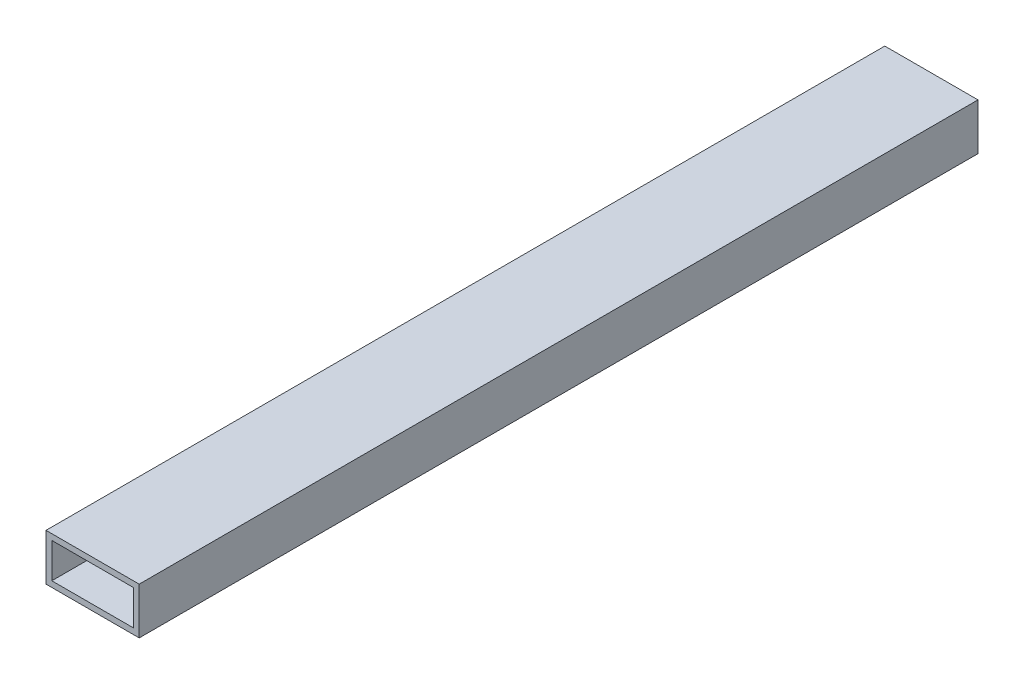
ISO-10303-21;
HEADER;
FILE_DESCRIPTION(('STEP AP214'),'2;1');
FILE_NAME('part.step','',(''),(''),'','','');
FILE_SCHEMA(('AUTOMOTIVE_DESIGN { 1 0 10303 214 1 1 1 1 }'));
ENDSEC;
DATA;
#1=APPLICATION_CONTEXT('core data for automotive mechanical design processes');
#2=APPLICATION_PROTOCOL_DEFINITION('international standard','automotive_design',2000,#1);
#3=PRODUCT_CONTEXT('',#1,'mechanical');
#4=PRODUCT('Part','Part','',(#3));
#5=PRODUCT_RELATED_PRODUCT_CATEGORY('part','',(#4));
#6=PRODUCT_DEFINITION_FORMATION('','',#4);
#7=PRODUCT_DEFINITION_CONTEXT('part definition',#1,'design');
#8=PRODUCT_DEFINITION('design','',#6,#7);
#9=PRODUCT_DEFINITION_SHAPE('','',#8);
#10=(LENGTH_UNIT() NAMED_UNIT(*) SI_UNIT(.MILLI.,.METRE.));
#11=(NAMED_UNIT(*) PLANE_ANGLE_UNIT() SI_UNIT($,.RADIAN.));
#12=(NAMED_UNIT(*) SI_UNIT($,.STERADIAN.) SOLID_ANGLE_UNIT());
#13=UNCERTAINTY_MEASURE_WITH_UNIT(LENGTH_MEASURE(1.E-05),#10,'distance_accuracy_value','');
#14=(GEOMETRIC_REPRESENTATION_CONTEXT(3) GLOBAL_UNCERTAINTY_ASSIGNED_CONTEXT((#13)) GLOBAL_UNIT_ASSIGNED_CONTEXT((#10,
#11,#12)) REPRESENTATION_CONTEXT('',''));
#15=CARTESIAN_POINT('',(0.,0.,0.));
#16=DIRECTION('',(0.,0.,1.));
#17=DIRECTION('',(1.,0.,0.));
#18=AXIS2_PLACEMENT_3D('',#15,#16,#17);
#19=CARTESIAN_POINT('',(-50.8,-25.4,457.2));
#20=DIRECTION('',(1.,0.,0.));
#21=DIRECTION('',(0.,0.,-1.));
#22=AXIS2_PLACEMENT_3D('',#19,#20,#21);
#23=PLANE('',#22);
#24=DIRECTION('',(0.,-1.,0.));
#25=VECTOR('',#24,1.);
#26=CARTESIAN_POINT('',(-50.8,25.4,-12.7));
#27=LINE('',#26,#25);
#28=CARTESIAN_POINT('',(-50.8,25.4,-12.7));
#29=VERTEX_POINT('',#28);
#30=CARTESIAN_POINT('',(-50.8,-25.4,-12.7));
#31=VERTEX_POINT('',#30);
#32=EDGE_CURVE('E55',#29,#31,#27,.T.);
#33=ORIENTED_EDGE('',*,*,#32,.F.);
#34=DIRECTION('',(0.,0.,-1.));
#35=VECTOR('',#34,1.);
#36=CARTESIAN_POINT('',(-50.8,25.4,457.2));
#37=LINE('',#36,#35);
#38=CARTESIAN_POINT('',(-50.8,25.4,-457.2));
#39=VERTEX_POINT('',#38);
#40=EDGE_CURVE('E176',#29,#39,#37,.T.);
#41=ORIENTED_EDGE('',*,*,#40,.T.);
#42=DIRECTION('',(0.,-1.,0.));
#43=VECTOR('',#42,1.);
#44=CARTESIAN_POINT('',(-50.8,-25.4,-457.2));
#45=LINE('',#44,#43);
#46=CARTESIAN_POINT('',(-50.8,-25.4,-457.2));
#47=VERTEX_POINT('',#46);
#48=EDGE_CURVE('E211',#39,#47,#45,.T.);
#49=ORIENTED_EDGE('',*,*,#48,.T.);
#50=DIRECTION('',(0.,0.,-1.));
#51=VECTOR('',#50,1.);
#52=CARTESIAN_POINT('',(-50.8,-25.4,457.2));
#53=LINE('',#52,#51);
#54=EDGE_CURVE('E60',#31,#47,#53,.T.);
#55=ORIENTED_EDGE('',*,*,#54,.F.);
#56=EDGE_LOOP('',(#33,#41,#49,#55));
#57=FACE_BOUND('',#56,.T.);
#58=ADVANCED_FACE('F38',(#57),#23,.F.);
#59=DIRECTION('',(0.,1.,0.));
#60=VECTOR('',#59,1.);
#61=CARTESIAN_POINT('',(-50.8,25.4,12.7));
#62=LINE('',#61,#60);
#63=CARTESIAN_POINT('',(-50.8,-25.4,12.7));
#64=VERTEX_POINT('',#63);
#65=CARTESIAN_POINT('',(-50.8,25.4,12.7));
#66=VERTEX_POINT('',#65);
#67=EDGE_CURVE('E147',#64,#66,#62,.T.);
#68=ORIENTED_EDGE('',*,*,#67,.F.);
#69=CARTESIAN_POINT('',(-50.8,-25.4,457.2));
#70=VERTEX_POINT('',#69);
#71=EDGE_CURVE('E191',#70,#64,#53,.T.);
#72=ORIENTED_EDGE('',*,*,#71,.F.);
#73=DIRECTION('',(0.,-1.,0.));
#74=VECTOR('',#73,1.);
#75=CARTESIAN_POINT('',(-50.8,-25.4,457.2));
#76=LINE('',#75,#74);
#77=CARTESIAN_POINT('',(-50.8,25.4,457.2));
#78=VERTEX_POINT('',#77);
#79=EDGE_CURVE('E219',#78,#70,#76,.T.);
#80=ORIENTED_EDGE('',*,*,#79,.F.);
#81=EDGE_CURVE('E47',#78,#66,#37,.T.);
#82=ORIENTED_EDGE('',*,*,#81,.T.);
#83=EDGE_LOOP('',(#68,#72,#80,#82));
#84=FACE_BOUND('',#83,.T.);
#85=ADVANCED_FACE('F278',(#84),#23,.F.);
#86=CARTESIAN_POINT('',(50.8,25.4,457.2));
#87=DIRECTION('',(0.,0.,-1.));
#88=DIRECTION('',(-1.,0.,0.));
#89=AXIS2_PLACEMENT_3D('',#86,#87,#88);
#90=PLANE('',#89);
#91=DIRECTION('',(0.,1.,0.));
#92=VECTOR('',#91,1.);
#93=CARTESIAN_POINT('',(50.8,-25.4,457.2));
#94=LINE('',#93,#92);
#95=CARTESIAN_POINT('',(50.8,-25.4,457.2));
#96=VERTEX_POINT('',#95);
#97=CARTESIAN_POINT('',(50.8,25.4,457.2));
#98=VERTEX_POINT('',#97);
#99=EDGE_CURVE('E210',#96,#98,#94,.T.);
#100=ORIENTED_EDGE('',*,*,#99,.T.);
#101=DIRECTION('',(-1.,0.,0.));
#102=VECTOR('',#101,1.);
#103=CARTESIAN_POINT('',(-50.8,25.4,457.2));
#104=LINE('',#103,#102);
#105=EDGE_CURVE('E221',#98,#78,#104,.T.);
#106=ORIENTED_EDGE('',*,*,#105,.T.);
#107=ORIENTED_EDGE('',*,*,#79,.T.);
#108=DIRECTION('',(1.,0.,0.));
#109=VECTOR('',#108,1.);
#110=CARTESIAN_POINT('',(-50.8,-25.4,457.2));
#111=LINE('',#110,#109);
#112=EDGE_CURVE('E207',#70,#96,#111,.T.);
#113=ORIENTED_EDGE('',*,*,#112,.T.);
#114=EDGE_LOOP('',(#100,#106,#107,#113));
#115=FACE_BOUND('',#114,.T.);
#116=DIRECTION('',(0.,1.,0.));
#117=VECTOR('',#116,1.);
#118=CARTESIAN_POINT('',(44.45,-19.05,457.2));
#119=LINE('',#118,#117);
#120=CARTESIAN_POINT('',(44.45,-19.05,457.2));
#121=VERTEX_POINT('',#120);
#122=CARTESIAN_POINT('',(44.45,19.05,457.2));
#123=VERTEX_POINT('',#122);
#124=EDGE_CURVE('E170',#121,#123,#119,.T.);
#125=ORIENTED_EDGE('',*,*,#124,.F.);
#126=DIRECTION('',(1.,0.,0.));
#127=VECTOR('',#126,1.);
#128=CARTESIAN_POINT('',(-44.45,-19.05,457.2));
#129=LINE('',#128,#127);
#130=CARTESIAN_POINT('',(-44.45,-19.05,457.2));
#131=VERTEX_POINT('',#130);
#132=EDGE_CURVE('E235',#131,#121,#129,.T.);
#133=ORIENTED_EDGE('',*,*,#132,.F.);
#134=DIRECTION('',(0.,-1.,0.));
#135=VECTOR('',#134,1.);
#136=CARTESIAN_POINT('',(-44.45,-19.05,457.2));
#137=LINE('',#136,#135);
#138=CARTESIAN_POINT('',(-44.45,19.05,457.2));
#139=VERTEX_POINT('',#138);
#140=EDGE_CURVE('E245',#139,#131,#137,.T.);
#141=ORIENTED_EDGE('',*,*,#140,.F.);
#142=DIRECTION('',(-1.,0.,0.));
#143=VECTOR('',#142,1.);
#144=CARTESIAN_POINT('',(-44.45,19.05,457.2));
#145=LINE('',#144,#143);
#146=EDGE_CURVE('E247',#123,#139,#145,.T.);
#147=ORIENTED_EDGE('',*,*,#146,.F.);
#148=EDGE_LOOP('',(#125,#133,#141,#147));
#149=FACE_BOUND('',#148,.T.);
#150=ADVANCED_FACE('F260',(#115,#149),#90,.F.);
#151=CARTESIAN_POINT('',(50.8,25.4,-457.2));
#152=DIRECTION('',(0.,0.,-1.));
#153=DIRECTION('',(-1.,0.,0.));
#154=AXIS2_PLACEMENT_3D('',#151,#152,#153);
#155=PLANE('',#154);
#156=DIRECTION('',(0.,1.,0.));
#157=VECTOR('',#156,1.);
#158=CARTESIAN_POINT('',(50.8,-25.4,-457.2));
#159=LINE('',#158,#157);
#160=CARTESIAN_POINT('',(50.8,-25.4,-457.2));
#161=VERTEX_POINT('',#160);
#162=CARTESIAN_POINT('',(50.8,25.4,-457.2));
#163=VERTEX_POINT('',#162);
#164=EDGE_CURVE('E214',#161,#163,#159,.T.);
#165=ORIENTED_EDGE('',*,*,#164,.F.);
#166=DIRECTION('',(1.,0.,0.));
#167=VECTOR('',#166,1.);
#168=CARTESIAN_POINT('',(-50.8,-25.4,-457.2));
#169=LINE('',#168,#167);
#170=EDGE_CURVE('E208',#47,#161,#169,.T.);
#171=ORIENTED_EDGE('',*,*,#170,.F.);
#172=ORIENTED_EDGE('',*,*,#48,.F.);
#173=DIRECTION('',(-1.,0.,0.));
#174=VECTOR('',#173,1.);
#175=CARTESIAN_POINT('',(-50.8,25.4,-457.2));
#176=LINE('',#175,#174);
#177=EDGE_CURVE('E189',#163,#39,#176,.T.);
#178=ORIENTED_EDGE('',*,*,#177,.F.);
#179=EDGE_LOOP('',(#165,#171,#172,#178));
#180=FACE_BOUND('',#179,.T.);
#181=DIRECTION('',(1.,0.,0.));
#182=VECTOR('',#181,1.);
#183=CARTESIAN_POINT('',(-44.45,-19.05,-457.2));
#184=LINE('',#183,#182);
#185=CARTESIAN_POINT('',(-44.45,-19.05,-457.2));
#186=VERTEX_POINT('',#185);
#187=CARTESIAN_POINT('',(44.45,-19.05,-457.2));
#188=VERTEX_POINT('',#187);
#189=EDGE_CURVE('E236',#186,#188,#184,.T.);
#190=ORIENTED_EDGE('',*,*,#189,.T.);
#191=DIRECTION('',(0.,1.,0.));
#192=VECTOR('',#191,1.);
#193=CARTESIAN_POINT('',(44.45,-19.05,-457.2));
#194=LINE('',#193,#192);
#195=CARTESIAN_POINT('',(44.45,19.05,-457.2));
#196=VERTEX_POINT('',#195);
#197=EDGE_CURVE('E150',#188,#196,#194,.T.);
#198=ORIENTED_EDGE('',*,*,#197,.T.);
#199=DIRECTION('',(-1.,0.,0.));
#200=VECTOR('',#199,1.);
#201=CARTESIAN_POINT('',(-44.45,19.05,-457.2));
#202=LINE('',#201,#200);
#203=CARTESIAN_POINT('',(-44.45,19.05,-457.2));
#204=VERTEX_POINT('',#203);
#205=EDGE_CURVE('E153',#196,#204,#202,.T.);
#206=ORIENTED_EDGE('',*,*,#205,.T.);
#207=DIRECTION('',(0.,-1.,0.));
#208=VECTOR('',#207,1.);
#209=CARTESIAN_POINT('',(-44.45,-19.05,-457.2));
#210=LINE('',#209,#208);
#211=EDGE_CURVE('E239',#204,#186,#210,.T.);
#212=ORIENTED_EDGE('',*,*,#211,.T.);
#213=EDGE_LOOP('',(#190,#198,#206,#212));
#214=FACE_BOUND('',#213,.T.);
#215=ADVANCED_FACE('F266',(#180,#214),#155,.T.);
#216=CARTESIAN_POINT('',(50.8,-25.4,457.2));
#217=DIRECTION('',(-1.,0.,0.));
#218=DIRECTION('',(0.,0.,1.));
#219=AXIS2_PLACEMENT_3D('',#216,#217,#218);
#220=PLANE('',#219);
#221=ORIENTED_EDGE('',*,*,#164,.T.);
#222=DIRECTION('',(0.,0.,-1.));
#223=VECTOR('',#222,1.);
#224=CARTESIAN_POINT('',(50.8,25.4,457.2));
#225=LINE('',#224,#223);
#226=EDGE_CURVE('E11',#98,#163,#225,.T.);
#227=ORIENTED_EDGE('',*,*,#226,.F.);
#228=ORIENTED_EDGE('',*,*,#99,.F.);
#229=DIRECTION('',(0.,0.,-1.));
#230=VECTOR('',#229,1.);
#231=CARTESIAN_POINT('',(50.8,-25.4,457.2));
#232=LINE('',#231,#230);
#233=EDGE_CURVE('E197',#96,#161,#232,.T.);
#234=ORIENTED_EDGE('',*,*,#233,.T.);
#235=EDGE_LOOP('',(#221,#227,#228,#234));
#236=FACE_BOUND('',#235,.T.);
#237=ADVANCED_FACE('F40',(#236),#220,.F.);
#238=CARTESIAN_POINT('',(-50.8,25.4,457.2));
#239=DIRECTION('',(0.,-1.,0.));
#240=DIRECTION('',(0.,0.,-1.));
#241=AXIS2_PLACEMENT_3D('',#238,#239,#240);
#242=PLANE('',#241);
#243=ORIENTED_EDGE('',*,*,#177,.T.);
#244=ORIENTED_EDGE('',*,*,#40,.F.);
#245=DIRECTION('',(1.,0.,0.));
#246=VECTOR('',#245,1.);
#247=CARTESIAN_POINT('',(-50.8254,25.4,-12.7));
#248=LINE('',#247,#246);
#249=CARTESIAN_POINT('',(-50.8254,25.4,-12.7));
#250=VERTEX_POINT('',#249);
#251=EDGE_CURVE('E163',#250,#29,#248,.T.);
#252=ORIENTED_EDGE('',*,*,#251,.F.);
#253=DIRECTION('',(0.,0.,-1.));
#254=VECTOR('',#253,1.);
#255=CARTESIAN_POINT('',(-50.8254,25.4,12.7));
#256=LINE('',#255,#254);
#257=CARTESIAN_POINT('',(-50.8254,25.4,12.7));
#258=VERTEX_POINT('',#257);
#259=EDGE_CURVE('E143',#258,#250,#256,.T.);
#260=ORIENTED_EDGE('',*,*,#259,.F.);
#261=DIRECTION('',(1.,0.,0.));
#262=VECTOR('',#261,1.);
#263=CARTESIAN_POINT('',(-50.8254,25.4,12.7));
#264=LINE('',#263,#262);
#265=EDGE_CURVE('E155',#258,#66,#264,.T.);
#266=ORIENTED_EDGE('',*,*,#265,.T.);
#267=ORIENTED_EDGE('',*,*,#81,.F.);
#268=ORIENTED_EDGE('',*,*,#105,.F.);
#269=ORIENTED_EDGE('',*,*,#226,.T.);
#270=EDGE_LOOP('',(#243,#244,#252,#260,#266,#267,#268,#269));
#271=FACE_BOUND('',#270,.T.);
#272=ADVANCED_FACE('F188',(#271),#242,.F.);
#273=CARTESIAN_POINT('',(-50.8,-25.4,457.2));
#274=DIRECTION('',(0.,1.,0.));
#275=DIRECTION('',(0.,0.,1.));
#276=AXIS2_PLACEMENT_3D('',#273,#274,#275);
#277=PLANE('',#276);
#278=ORIENTED_EDGE('',*,*,#170,.T.);
#279=ORIENTED_EDGE('',*,*,#233,.F.);
#280=ORIENTED_EDGE('',*,*,#112,.F.);
#281=ORIENTED_EDGE('',*,*,#71,.T.);
#282=DIRECTION('',(1.,0.,0.));
#283=VECTOR('',#282,1.);
#284=CARTESIAN_POINT('',(-50.8254,-25.4,12.7));
#285=LINE('',#284,#283);
#286=CARTESIAN_POINT('',(-50.8254,-25.4,12.7));
#287=VERTEX_POINT('',#286);
#288=EDGE_CURVE('E134',#287,#64,#285,.T.);
#289=ORIENTED_EDGE('',*,*,#288,.F.);
#290=DIRECTION('',(0.,0.,1.));
#291=VECTOR('',#290,1.);
#292=CARTESIAN_POINT('',(-50.8254,-25.4,12.7));
#293=LINE('',#292,#291);
#294=CARTESIAN_POINT('',(-50.8254,-25.4,-12.7));
#295=VERTEX_POINT('',#294);
#296=EDGE_CURVE('E127',#295,#287,#293,.T.);
#297=ORIENTED_EDGE('',*,*,#296,.F.);
#298=DIRECTION('',(1.,0.,0.));
#299=VECTOR('',#298,1.);
#300=CARTESIAN_POINT('',(-50.8254,-25.4,-12.7));
#301=LINE('',#300,#299);
#302=EDGE_CURVE('E131',#295,#31,#301,.T.);
#303=ORIENTED_EDGE('',*,*,#302,.T.);
#304=ORIENTED_EDGE('',*,*,#54,.T.);
#305=EDGE_LOOP('',(#278,#279,#280,#281,#289,#297,#303,#304));
#306=FACE_BOUND('',#305,.T.);
#307=ADVANCED_FACE('F129',(#306),#277,.F.);
#308=CARTESIAN_POINT('',(44.45,-19.05,457.2));
#309=DIRECTION('',(-1.,0.,0.));
#310=DIRECTION('',(0.,0.,1.));
#311=AXIS2_PLACEMENT_3D('',#308,#309,#310);
#312=PLANE('',#311);
#313=ORIENTED_EDGE('',*,*,#197,.F.);
#314=DIRECTION('',(0.,0.,-1.));
#315=VECTOR('',#314,1.);
#316=CARTESIAN_POINT('',(44.45,-19.05,457.2));
#317=LINE('',#316,#315);
#318=EDGE_CURVE('E232',#121,#188,#317,.T.);
#319=ORIENTED_EDGE('',*,*,#318,.F.);
#320=ORIENTED_EDGE('',*,*,#124,.T.);
#321=DIRECTION('',(0.,0.,-1.));
#322=VECTOR('',#321,1.);
#323=CARTESIAN_POINT('',(44.45,19.05,457.2));
#324=LINE('',#323,#322);
#325=EDGE_CURVE('E217',#123,#196,#324,.T.);
#326=ORIENTED_EDGE('',*,*,#325,.T.);
#327=EDGE_LOOP('',(#313,#319,#320,#326));
#328=FACE_BOUND('',#327,.T.);
#329=ADVANCED_FACE('F255',(#328),#312,.T.);
#330=CARTESIAN_POINT('',(-44.45,19.05,457.2));
#331=DIRECTION('',(0.,-1.,0.));
#332=DIRECTION('',(0.,0.,-1.));
#333=AXIS2_PLACEMENT_3D('',#330,#331,#332);
#334=PLANE('',#333);
#335=ORIENTED_EDGE('',*,*,#205,.F.);
#336=ORIENTED_EDGE('',*,*,#325,.F.);
#337=ORIENTED_EDGE('',*,*,#146,.T.);
#338=DIRECTION('',(0.,0.,-1.));
#339=VECTOR('',#338,1.);
#340=CARTESIAN_POINT('',(-44.45,19.05,457.2));
#341=LINE('',#340,#339);
#342=EDGE_CURVE('E227',#139,#204,#341,.T.);
#343=ORIENTED_EDGE('',*,*,#342,.T.);
#344=EDGE_LOOP('',(#335,#336,#337,#343));
#345=FACE_BOUND('',#344,.T.);
#346=ADVANCED_FACE('F258',(#345),#334,.T.);
#347=CARTESIAN_POINT('',(-44.45,-19.05,457.2));
#348=DIRECTION('',(1.,0.,0.));
#349=DIRECTION('',(0.,0.,-1.));
#350=AXIS2_PLACEMENT_3D('',#347,#348,#349);
#351=PLANE('',#350);
#352=ORIENTED_EDGE('',*,*,#211,.F.);
#353=ORIENTED_EDGE('',*,*,#342,.F.);
#354=ORIENTED_EDGE('',*,*,#140,.T.);
#355=DIRECTION('',(0.,0.,-1.));
#356=VECTOR('',#355,1.);
#357=CARTESIAN_POINT('',(-44.45,-19.05,457.2));
#358=LINE('',#357,#356);
#359=EDGE_CURVE('E230',#131,#186,#358,.T.);
#360=ORIENTED_EDGE('',*,*,#359,.T.);
#361=EDGE_LOOP('',(#352,#353,#354,#360));
#362=FACE_BOUND('',#361,.T.);
#363=ADVANCED_FACE('F263',(#362),#351,.T.);
#364=CARTESIAN_POINT('',(-44.45,-19.05,457.2));
#365=DIRECTION('',(0.,1.,0.));
#366=DIRECTION('',(0.,0.,1.));
#367=AXIS2_PLACEMENT_3D('',#364,#365,#366);
#368=PLANE('',#367);
#369=ORIENTED_EDGE('',*,*,#189,.F.);
#370=ORIENTED_EDGE('',*,*,#359,.F.);
#371=ORIENTED_EDGE('',*,*,#132,.T.);
#372=ORIENTED_EDGE('',*,*,#318,.T.);
#373=EDGE_LOOP('',(#369,#370,#371,#372));
#374=FACE_BOUND('',#373,.T.);
#375=ADVANCED_FACE('F268',(#374),#368,.T.);
#376=CARTESIAN_POINT('',(-50.8254,25.4,-12.7));
#377=DIRECTION('',(0.,0.,1.));
#378=DIRECTION('',(1.,0.,0.));
#379=AXIS2_PLACEMENT_3D('',#376,#377,#378);
#380=PLANE('',#379);
#381=ORIENTED_EDGE('',*,*,#32,.T.);
#382=ORIENTED_EDGE('',*,*,#302,.F.);
#383=DIRECTION('',(0.,-1.,0.));
#384=VECTOR('',#383,1.);
#385=CARTESIAN_POINT('',(-50.8254,25.4,-12.7));
#386=LINE('',#385,#384);
#387=EDGE_CURVE('E138',#250,#295,#386,.T.);
#388=ORIENTED_EDGE('',*,*,#387,.F.);
#389=ORIENTED_EDGE('',*,*,#251,.T.);
#390=EDGE_LOOP('',(#381,#382,#388,#389));
#391=FACE_BOUND('',#390,.T.);
#392=ADVANCED_FACE('F149',(#391),#380,.F.);
#393=CARTESIAN_POINT('',(-50.8254,25.4,12.7));
#394=DIRECTION('',(0.,0.,-1.));
#395=DIRECTION('',(-1.,0.,0.));
#396=AXIS2_PLACEMENT_3D('',#393,#394,#395);
#397=PLANE('',#396);
#398=ORIENTED_EDGE('',*,*,#67,.T.);
#399=ORIENTED_EDGE('',*,*,#265,.F.);
#400=DIRECTION('',(0.,1.,0.));
#401=VECTOR('',#400,1.);
#402=CARTESIAN_POINT('',(-50.8254,25.4,12.7));
#403=LINE('',#402,#401);
#404=EDGE_CURVE('E137',#287,#258,#403,.T.);
#405=ORIENTED_EDGE('',*,*,#404,.F.);
#406=ORIENTED_EDGE('',*,*,#288,.T.);
#407=EDGE_LOOP('',(#398,#399,#405,#406));
#408=FACE_BOUND('',#407,.T.);
#409=ADVANCED_FACE('F186',(#408),#397,.F.);
#410=CARTESIAN_POINT('',(-50.8254,-25.4,-12.7));
#411=DIRECTION('',(1.,0.,0.));
#412=DIRECTION('',(0.,0.,-1.));
#413=AXIS2_PLACEMENT_3D('',#410,#411,#412);
#414=PLANE('',#413);
#415=ORIENTED_EDGE('',*,*,#387,.T.);
#416=ORIENTED_EDGE('',*,*,#296,.T.);
#417=ORIENTED_EDGE('',*,*,#404,.T.);
#418=ORIENTED_EDGE('',*,*,#259,.T.);
#419=EDGE_LOOP('',(#415,#416,#417,#418));
#420=FACE_BOUND('',#419,.T.);
#421=ADVANCED_FACE('F141',(#420),#414,.F.);
#422=CLOSED_SHELL('',(#58,#85,#150,#215,#237,#272,#307,#329,#346,#363,#375,#392,#409,#421));
#423=MANIFOLD_SOLID_BREP('B2',#422);
#424=ADVANCED_BREP_SHAPE_REPRESENTATION('',(#18,#423),#14);
#425=SHAPE_DEFINITION_REPRESENTATION(#9,#424);
ENDSEC;
END-ISO-10303-21;
